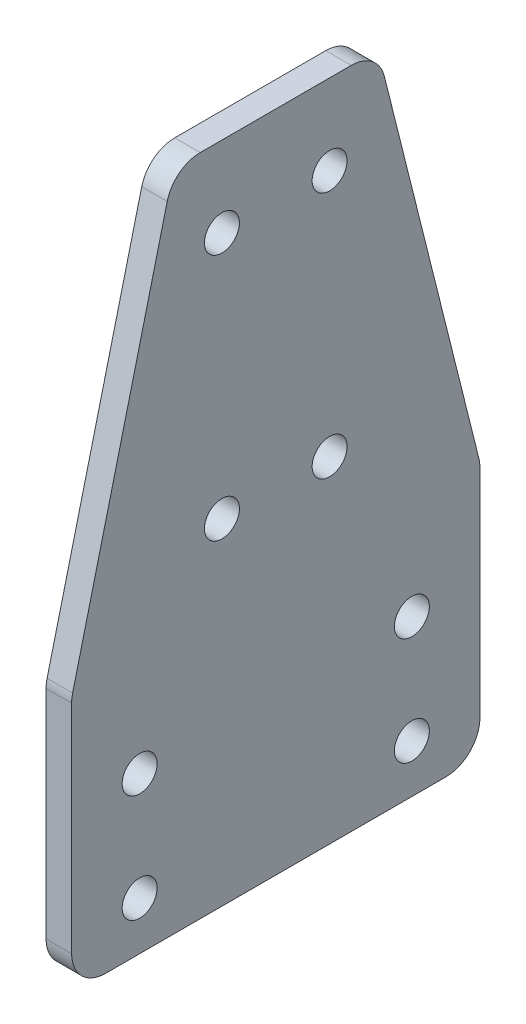
ISO-10303-21;
HEADER;
FILE_DESCRIPTION(('STEP AP214'),'2;1');
FILE_NAME('part.step','',(''),(''),'','','');
FILE_SCHEMA(('AUTOMOTIVE_DESIGN { 1 0 10303 214 1 1 1 1 }'));
ENDSEC;
DATA;
#1=APPLICATION_CONTEXT('core data for automotive mechanical design processes');
#2=APPLICATION_PROTOCOL_DEFINITION('international standard','automotive_design',2000,#1);
#3=PRODUCT_CONTEXT('',#1,'mechanical');
#4=PRODUCT('Part','Part','',(#3));
#5=PRODUCT_RELATED_PRODUCT_CATEGORY('part','',(#4));
#6=PRODUCT_DEFINITION_FORMATION('','',#4);
#7=PRODUCT_DEFINITION_CONTEXT('part definition',#1,'design');
#8=PRODUCT_DEFINITION('design','',#6,#7);
#9=PRODUCT_DEFINITION_SHAPE('','',#8);
#10=(LENGTH_UNIT() NAMED_UNIT(*) SI_UNIT(.MILLI.,.METRE.));
#11=(NAMED_UNIT(*) PLANE_ANGLE_UNIT() SI_UNIT($,.RADIAN.));
#12=(NAMED_UNIT(*) SI_UNIT($,.STERADIAN.) SOLID_ANGLE_UNIT());
#13=UNCERTAINTY_MEASURE_WITH_UNIT(LENGTH_MEASURE(1.E-05),#10,'distance_accuracy_value','');
#14=(GEOMETRIC_REPRESENTATION_CONTEXT(3) GLOBAL_UNCERTAINTY_ASSIGNED_CONTEXT((#13)) GLOBAL_UNIT_ASSIGNED_CONTEXT((#10,
#11,#12)) REPRESENTATION_CONTEXT('',''));
#15=CARTESIAN_POINT('',(0.,0.,0.));
#16=DIRECTION('',(0.,0.,1.));
#17=DIRECTION('',(1.,0.,0.));
#18=AXIS2_PLACEMENT_3D('',#15,#16,#17);
#19=CARTESIAN_POINT('',(-234.95,47.625,-130.7));
#20=DIRECTION('',(0.,0.,1.));
#21=DIRECTION('',(0.,-1.,0.));
#22=AXIS2_PLACEMENT_3D('',#19,#20,#21);
#23=PLANE('',#22);
#24=DIRECTION('',(0.,-1.,0.));
#25=VECTOR('',#24,1.);
#26=CARTESIAN_POINT('',(-234.95,47.625,-130.7));
#27=LINE('',#26,#25);
#28=CARTESIAN_POINT('',(-234.95,46.8432792773278,-130.7));
#29=VERTEX_POINT('',#28);
#30=CARTESIAN_POINT('',(-234.95,6.34999999999999,-130.7));
#31=VERTEX_POINT('',#30);
#32=EDGE_CURVE('E248',#29,#31,#27,.T.);
#33=ORIENTED_EDGE('',*,*,#32,.T.);
#34=DIRECTION('',(1.,0.,0.));
#35=VECTOR('',#34,1.);
#36=CARTESIAN_POINT('',(-234.95,6.34999999999999,-130.7));
#37=LINE('',#36,#35);
#38=CARTESIAN_POINT('',(-230.1875,6.34999999999999,-130.7));
#39=VERTEX_POINT('',#38);
#40=EDGE_CURVE('E156',#31,#39,#37,.T.);
#41=ORIENTED_EDGE('',*,*,#40,.T.);
#42=DIRECTION('',(0.,-1.,0.));
#43=VECTOR('',#42,1.);
#44=CARTESIAN_POINT('',(-230.1875,47.625,-130.7));
#45=LINE('',#44,#43);
#46=CARTESIAN_POINT('',(-230.1875,46.8432792773278,-130.7));
#47=VERTEX_POINT('',#46);
#48=EDGE_CURVE('E139',#47,#39,#45,.T.);
#49=ORIENTED_EDGE('',*,*,#48,.F.);
#50=DIRECTION('',(1.,0.,0.));
#51=VECTOR('',#50,1.);
#52=CARTESIAN_POINT('',(-234.95,46.8432792773278,-130.7));
#53=LINE('',#52,#51);
#54=EDGE_CURVE('E153',#47,#29,#53,.F.);
#55=ORIENTED_EDGE('',*,*,#54,.T.);
#56=EDGE_LOOP('',(#33,#41,#49,#55));
#57=FACE_BOUND('',#56,.T.);
#58=ADVANCED_FACE('F45',(#57),#23,.T.);
#59=CARTESIAN_POINT('',(-234.95,123.825,-149.75));
#60=DIRECTION('',(0.,0.242535625036333,0.970142500145332));
#61=DIRECTION('',(0.,-0.970142500145332,0.242535625036333));
#62=AXIS2_PLACEMENT_3D('',#59,#60,#61);
#63=PLANE('',#62);
#64=DIRECTION('',(0.,-0.970142500145332,0.242535625036333));
#65=VECTOR('',#64,1.);
#66=CARTESIAN_POINT('',(-234.95,123.825,-149.75));
#67=LINE('',#66,#65);
#68=CARTESIAN_POINT('',(-234.95,119.015101218981,-148.547525304745));
#69=VERTEX_POINT('',#68);
#70=CARTESIAN_POINT('',(-234.95,48.3833804963085,-130.889595124077));
#71=VERTEX_POINT('',#70);
#72=EDGE_CURVE('E165',#69,#71,#67,.T.);
#73=ORIENTED_EDGE('',*,*,#72,.T.);
#74=DIRECTION('',(1.,0.,0.));
#75=VECTOR('',#74,1.);
#76=CARTESIAN_POINT('',(-234.95,48.3833804963085,-130.889595124077));
#77=LINE('',#76,#75);
#78=CARTESIAN_POINT('',(-230.1875,48.3833804963085,-130.889595124077));
#79=VERTEX_POINT('',#78);
#80=EDGE_CURVE('E228',#71,#79,#77,.T.);
#81=ORIENTED_EDGE('',*,*,#80,.T.);
#82=DIRECTION('',(0.,-0.970142500145332,0.242535625036333));
#83=VECTOR('',#82,1.);
#84=CARTESIAN_POINT('',(-230.1875,123.825,-149.75));
#85=LINE('',#84,#83);
#86=CARTESIAN_POINT('',(-230.1875,119.015101218981,-148.547525304745));
#87=VERTEX_POINT('',#86);
#88=EDGE_CURVE('E141',#87,#79,#85,.T.);
#89=ORIENTED_EDGE('',*,*,#88,.F.);
#90=DIRECTION('',(1.,0.,0.));
#91=VECTOR('',#90,1.);
#92=CARTESIAN_POINT('',(-234.95,119.015101218981,-148.547525304745));
#93=LINE('',#92,#91);
#94=EDGE_CURVE('E225',#87,#69,#93,.F.);
#95=ORIENTED_EDGE('',*,*,#94,.T.);
#96=EDGE_LOOP('',(#73,#81,#89,#95));
#97=FACE_BOUND('',#96,.T.);
#98=ADVANCED_FACE('F379',(#97),#63,.T.);
#99=CARTESIAN_POINT('',(-234.95,123.825,-187.85));
#100=DIRECTION('',(0.,1.,0.));
#101=DIRECTION('',(0.,0.,1.));
#102=AXIS2_PLACEMENT_3D('',#99,#100,#101);
#103=PLANE('',#102);
#104=DIRECTION('',(0.,0.,1.));
#105=VECTOR('',#104,1.);
#106=CARTESIAN_POINT('',(-230.1875,123.825,-187.85));
#107=LINE('',#106,#105);
#108=CARTESIAN_POINT('',(-230.1875,123.825,-182.892069819332));
#109=VERTEX_POINT('',#108);
#110=CARTESIAN_POINT('',(-230.1875,123.825,-154.707930180668));
#111=VERTEX_POINT('',#110);
#112=EDGE_CURVE('E238',#109,#111,#107,.T.);
#113=ORIENTED_EDGE('',*,*,#112,.F.);
#114=DIRECTION('',(1.,0.,0.));
#115=VECTOR('',#114,1.);
#116=CARTESIAN_POINT('',(-234.95,123.825,-182.892069819332));
#117=LINE('',#116,#115);
#118=CARTESIAN_POINT('',(-234.95,123.825,-182.892069819332));
#119=VERTEX_POINT('',#118);
#120=EDGE_CURVE('E11',#109,#119,#117,.F.);
#121=ORIENTED_EDGE('',*,*,#120,.T.);
#122=DIRECTION('',(0.,0.,1.));
#123=VECTOR('',#122,1.);
#124=CARTESIAN_POINT('',(-234.95,123.825,-187.85));
#125=LINE('',#124,#123);
#126=CARTESIAN_POINT('',(-234.95,123.825,-154.707930180668));
#127=VERTEX_POINT('',#126);
#128=EDGE_CURVE('E172',#119,#127,#125,.T.);
#129=ORIENTED_EDGE('',*,*,#128,.T.);
#130=DIRECTION('',(1.,0.,0.));
#131=VECTOR('',#130,1.);
#132=CARTESIAN_POINT('',(-234.95,123.825,-154.707930180668));
#133=LINE('',#132,#131);
#134=EDGE_CURVE('E54',#127,#111,#133,.T.);
#135=ORIENTED_EDGE('',*,*,#134,.T.);
#136=EDGE_LOOP('',(#113,#121,#129,#135));
#137=FACE_BOUND('',#136,.T.);
#138=ADVANCED_FACE('F237',(#137),#103,.T.);
#139=CARTESIAN_POINT('',(-234.95,47.625,-206.9));
#140=DIRECTION('',(0.,0.242535625036333,-0.970142500145332));
#141=DIRECTION('',(0.,0.970142500145332,0.242535625036333));
#142=AXIS2_PLACEMENT_3D('',#139,#140,#141);
#143=PLANE('',#142);
#144=DIRECTION('',(0.,0.970142500145332,0.242535625036333));
#145=VECTOR('',#144,1.);
#146=CARTESIAN_POINT('',(-230.1875,47.625,-206.9));
#147=LINE('',#146,#145);
#148=CARTESIAN_POINT('',(-230.1875,48.3833804963085,-206.710404875923));
#149=VERTEX_POINT('',#148);
#150=CARTESIAN_POINT('',(-230.1875,119.015101218981,-189.052474695255));
#151=VERTEX_POINT('',#150);
#152=EDGE_CURVE('E245',#149,#151,#147,.T.);
#153=ORIENTED_EDGE('',*,*,#152,.F.);
#154=DIRECTION('',(1.,0.,0.));
#155=VECTOR('',#154,1.);
#156=CARTESIAN_POINT('',(-234.95,48.3833804963085,-206.710404875923));
#157=LINE('',#156,#155);
#158=CARTESIAN_POINT('',(-234.95,48.3833804963085,-206.710404875923));
#159=VERTEX_POINT('',#158);
#160=EDGE_CURVE('E222',#149,#159,#157,.F.);
#161=ORIENTED_EDGE('',*,*,#160,.T.);
#162=DIRECTION('',(0.,0.970142500145332,0.242535625036333));
#163=VECTOR('',#162,1.);
#164=CARTESIAN_POINT('',(-234.95,47.625,-206.9));
#165=LINE('',#164,#163);
#166=CARTESIAN_POINT('',(-234.95,119.015101218981,-189.052474695255));
#167=VERTEX_POINT('',#166);
#168=EDGE_CURVE('E260',#159,#167,#165,.T.);
#169=ORIENTED_EDGE('',*,*,#168,.T.);
#170=DIRECTION('',(1.,0.,0.));
#171=VECTOR('',#170,1.);
#172=CARTESIAN_POINT('',(-234.95,119.015101218981,-189.052474695255));
#173=LINE('',#172,#171);
#174=EDGE_CURVE('E218',#167,#151,#173,.T.);
#175=ORIENTED_EDGE('',*,*,#174,.T.);
#176=EDGE_LOOP('',(#153,#161,#169,#175));
#177=FACE_BOUND('',#176,.T.);
#178=ADVANCED_FACE('F413',(#177),#143,.T.);
#179=CARTESIAN_POINT('',(-234.95,0.,-206.9));
#180=DIRECTION('',(0.,0.,-1.));
#181=DIRECTION('',(-1.,0.,0.));
#182=AXIS2_PLACEMENT_3D('',#179,#180,#181);
#183=PLANE('',#182);
#184=DIRECTION('',(0.,1.,0.));
#185=VECTOR('',#184,1.);
#186=CARTESIAN_POINT('',(-230.1875,0.,-206.9));
#187=LINE('',#186,#185);
#188=CARTESIAN_POINT('',(-230.1875,6.35,-206.9));
#189=VERTEX_POINT('',#188);
#190=CARTESIAN_POINT('',(-230.1875,46.8432792773278,-206.9));
#191=VERTEX_POINT('',#190);
#192=EDGE_CURVE('E249',#189,#191,#187,.T.);
#193=ORIENTED_EDGE('',*,*,#192,.F.);
#194=DIRECTION('',(1.,0.,0.));
#195=VECTOR('',#194,1.);
#196=CARTESIAN_POINT('',(-234.95,6.35,-206.9));
#197=LINE('',#196,#195);
#198=CARTESIAN_POINT('',(-234.95,6.35,-206.9));
#199=VERTEX_POINT('',#198);
#200=EDGE_CURVE('E68',#189,#199,#197,.F.);
#201=ORIENTED_EDGE('',*,*,#200,.T.);
#202=DIRECTION('',(0.,1.,0.));
#203=VECTOR('',#202,1.);
#204=CARTESIAN_POINT('',(-234.95,0.,-206.9));
#205=LINE('',#204,#203);
#206=CARTESIAN_POINT('',(-234.95,46.8432792773278,-206.9));
#207=VERTEX_POINT('',#206);
#208=EDGE_CURVE('E264',#199,#207,#205,.T.);
#209=ORIENTED_EDGE('',*,*,#208,.T.);
#210=DIRECTION('',(1.,0.,0.));
#211=VECTOR('',#210,1.);
#212=CARTESIAN_POINT('',(-234.95,46.8432792773278,-206.9));
#213=LINE('',#212,#211);
#214=EDGE_CURVE('E212',#207,#191,#213,.T.);
#215=ORIENTED_EDGE('',*,*,#214,.T.);
#216=EDGE_LOOP('',(#193,#201,#209,#215));
#217=FACE_BOUND('',#216,.T.);
#218=ADVANCED_FACE('F416',(#217),#183,.T.);
#219=CARTESIAN_POINT('',(-234.95,0.,-130.7));
#220=DIRECTION('',(0.,-1.,0.));
#221=DIRECTION('',(0.,0.,-1.));
#222=AXIS2_PLACEMENT_3D('',#219,#220,#221);
#223=PLANE('',#222);
#224=DIRECTION('',(0.,0.,-1.));
#225=VECTOR('',#224,1.);
#226=CARTESIAN_POINT('',(-230.1875,0.,-130.7));
#227=LINE('',#226,#225);
#228=CARTESIAN_POINT('',(-230.1875,0.,-137.05));
#229=VERTEX_POINT('',#228);
#230=CARTESIAN_POINT('',(-230.1875,0.,-200.55));
#231=VERTEX_POINT('',#230);
#232=EDGE_CURVE('E158',#229,#231,#227,.T.);
#233=ORIENTED_EDGE('',*,*,#232,.F.);
#234=DIRECTION('',(1.,0.,0.));
#235=VECTOR('',#234,1.);
#236=CARTESIAN_POINT('',(-234.95,0.,-137.05));
#237=LINE('',#236,#235);
#238=CARTESIAN_POINT('',(-234.95,0.,-137.05));
#239=VERTEX_POINT('',#238);
#240=EDGE_CURVE('E193',#229,#239,#237,.F.);
#241=ORIENTED_EDGE('',*,*,#240,.T.);
#242=DIRECTION('',(0.,0.,-1.));
#243=VECTOR('',#242,1.);
#244=CARTESIAN_POINT('',(-234.95,0.,-130.7));
#245=LINE('',#244,#243);
#246=CARTESIAN_POINT('',(-234.95,0.,-200.55));
#247=VERTEX_POINT('',#246);
#248=EDGE_CURVE('E267',#239,#247,#245,.T.);
#249=ORIENTED_EDGE('',*,*,#248,.T.);
#250=DIRECTION('',(1.,0.,0.));
#251=VECTOR('',#250,1.);
#252=CARTESIAN_POINT('',(-234.95,0.,-200.55));
#253=LINE('',#252,#251);
#254=EDGE_CURVE('E189',#247,#231,#253,.T.);
#255=ORIENTED_EDGE('',*,*,#254,.T.);
#256=EDGE_LOOP('',(#233,#241,#249,#255));
#257=FACE_BOUND('',#256,.T.);
#258=ADVANCED_FACE('F388',(#257),#223,.T.);
#259=CARTESIAN_POINT('',(-234.95,0.,0.));
#260=DIRECTION('',(1.,0.,0.));
#261=DIRECTION('',(0.,0.,-1.));
#262=AXIS2_PLACEMENT_3D('',#259,#260,#261);
#263=PLANE('',#262);
#264=CARTESIAN_POINT('',(-234.95,9.,-194.2));
#265=DIRECTION('',(1.,0.,0.));
#266=DIRECTION('',(0.,0.,-1.));
#267=AXIS2_PLACEMENT_3D('',#264,#265,#266);
#268=CIRCLE('',#267,3.26390000000001);
#269=CARTESIAN_POINT('',(-234.95,9.,-197.4639));
#270=VERTEX_POINT('',#269);
#271=EDGE_CURVE('E325',#270,#270,#268,.T.);
#272=ORIENTED_EDGE('',*,*,#271,.T.);
#273=EDGE_LOOP('',(#272));
#274=FACE_BOUND('',#273,.T.);
#275=CARTESIAN_POINT('',(-234.95,9.,-143.4));
#276=DIRECTION('',(1.,0.,0.));
#277=DIRECTION('',(0.,0.,-1.));
#278=AXIS2_PLACEMENT_3D('',#275,#276,#277);
#279=CIRCLE('',#278,3.26390000000001);
#280=CARTESIAN_POINT('',(-234.95,9.,-146.6639));
#281=VERTEX_POINT('',#280);
#282=EDGE_CURVE('E317',#281,#281,#279,.T.);
#283=ORIENTED_EDGE('',*,*,#282,.T.);
#284=EDGE_LOOP('',(#283));
#285=FACE_BOUND('',#284,.T.);
#286=CARTESIAN_POINT('',(-234.95,29.1,-143.4));
#287=DIRECTION('',(1.,0.,0.));
#288=DIRECTION('',(0.,0.,-1.));
#289=AXIS2_PLACEMENT_3D('',#286,#287,#288);
#290=CIRCLE('',#289,3.26390000000001);
#291=CARTESIAN_POINT('',(-234.95,29.1,-146.6639));
#292=VERTEX_POINT('',#291);
#293=EDGE_CURVE('E309',#292,#292,#290,.T.);
#294=ORIENTED_EDGE('',*,*,#293,.T.);
#295=EDGE_LOOP('',(#294));
#296=FACE_BOUND('',#295,.T.);
#297=CARTESIAN_POINT('',(-234.95,62.625,-158.75));
#298=DIRECTION('',(1.,0.,0.));
#299=DIRECTION('',(0.,0.,-1.));
#300=AXIS2_PLACEMENT_3D('',#297,#298,#299);
#301=CIRCLE('',#300,3.26389999999998);
#302=CARTESIAN_POINT('',(-234.95,62.625,-162.0139));
#303=VERTEX_POINT('',#302);
#304=EDGE_CURVE('E301',#303,#303,#301,.T.);
#305=ORIENTED_EDGE('',*,*,#304,.T.);
#306=EDGE_LOOP('',(#305));
#307=FACE_BOUND('',#306,.T.);
#308=CARTESIAN_POINT('',(-234.95,62.625,-178.85));
#309=DIRECTION('',(1.,0.,0.));
#310=DIRECTION('',(0.,0.,-1.));
#311=AXIS2_PLACEMENT_3D('',#308,#309,#310);
#312=CIRCLE('',#311,3.26390000000001);
#313=CARTESIAN_POINT('',(-234.95,62.625,-182.1139));
#314=VERTEX_POINT('',#313);
#315=EDGE_CURVE('E293',#314,#314,#312,.T.);
#316=ORIENTED_EDGE('',*,*,#315,.T.);
#317=EDGE_LOOP('',(#316));
#318=FACE_BOUND('',#317,.T.);
#319=CARTESIAN_POINT('',(-234.95,108.825000028,-178.85));
#320=DIRECTION('',(1.,0.,0.));
#321=DIRECTION('',(0.,0.,-1.));
#322=AXIS2_PLACEMENT_3D('',#319,#320,#321);
#323=CIRCLE('',#322,3.26390000000001);
#324=CARTESIAN_POINT('',(-234.95,108.825000028,-182.1139));
#325=VERTEX_POINT('',#324);
#326=EDGE_CURVE('E285',#325,#325,#323,.T.);
#327=ORIENTED_EDGE('',*,*,#326,.T.);
#328=EDGE_LOOP('',(#327));
#329=FACE_BOUND('',#328,.T.);
#330=CARTESIAN_POINT('',(-234.95,108.825000028,-158.75));
#331=DIRECTION('',(1.,0.,0.));
#332=DIRECTION('',(0.,0.,-1.));
#333=AXIS2_PLACEMENT_3D('',#330,#331,#332);
#334=CIRCLE('',#333,3.26389999999998);
#335=CARTESIAN_POINT('',(-234.95,108.825000028,-162.0139));
#336=VERTEX_POINT('',#335);
#337=EDGE_CURVE('E277',#336,#336,#334,.T.);
#338=ORIENTED_EDGE('',*,*,#337,.T.);
#339=EDGE_LOOP('',(#338));
#340=FACE_BOUND('',#339,.T.);
#341=CARTESIAN_POINT('',(-234.95,29.1,-194.2));
#342=DIRECTION('',(1.,0.,0.));
#343=DIRECTION('',(0.,0.,-1.));
#344=AXIS2_PLACEMENT_3D('',#341,#342,#343);
#345=CIRCLE('',#344,3.26390000000001);
#346=CARTESIAN_POINT('',(-234.95,29.1,-197.4639));
#347=VERTEX_POINT('',#346);
#348=EDGE_CURVE('E159',#347,#347,#345,.T.);
#349=ORIENTED_EDGE('',*,*,#348,.T.);
#350=EDGE_LOOP('',(#349));
#351=FACE_BOUND('',#350,.T.);
#352=ORIENTED_EDGE('',*,*,#248,.F.);
#353=CARTESIAN_POINT('',(-234.95,6.35,-137.05));
#354=DIRECTION('',(1.,0.,0.));
#355=DIRECTION('',(0.,0.,-1.));
#356=AXIS2_PLACEMENT_3D('',#353,#354,#355);
#357=CIRCLE('',#356,6.35);
#358=EDGE_CURVE('E209',#239,#31,#357,.F.);
#359=ORIENTED_EDGE('',*,*,#358,.T.);
#360=ORIENTED_EDGE('',*,*,#32,.F.);
#361=CARTESIAN_POINT('',(-234.95,46.8432792773278,-137.05));
#362=DIRECTION('',(1.,0.,0.));
#363=DIRECTION('',(0.,0.,-1.));
#364=AXIS2_PLACEMENT_3D('',#361,#362,#363);
#365=CIRCLE('',#364,6.35);
#366=EDGE_CURVE('E163',#29,#71,#365,.F.);
#367=ORIENTED_EDGE('',*,*,#366,.T.);
#368=ORIENTED_EDGE('',*,*,#72,.F.);
#369=CARTESIAN_POINT('',(-234.95,117.475,-154.707930180668));
#370=DIRECTION('',(1.,0.,0.));
#371=DIRECTION('',(0.,0.,-1.));
#372=AXIS2_PLACEMENT_3D('',#369,#370,#371);
#373=CIRCLE('',#372,6.35);
#374=EDGE_CURVE('E196',#69,#127,#373,.F.);
#375=ORIENTED_EDGE('',*,*,#374,.T.);
#376=ORIENTED_EDGE('',*,*,#128,.F.);
#377=CARTESIAN_POINT('',(-234.95,117.475,-182.892069819332));
#378=DIRECTION('',(1.,0.,0.));
#379=DIRECTION('',(0.,0.,-1.));
#380=AXIS2_PLACEMENT_3D('',#377,#378,#379);
#381=CIRCLE('',#380,6.35);
#382=EDGE_CURVE('E199',#119,#167,#381,.F.);
#383=ORIENTED_EDGE('',*,*,#382,.T.);
#384=ORIENTED_EDGE('',*,*,#168,.F.);
#385=CARTESIAN_POINT('',(-234.95,46.8432792773278,-200.55));
#386=DIRECTION('',(1.,0.,0.));
#387=DIRECTION('',(0.,0.,-1.));
#388=AXIS2_PLACEMENT_3D('',#385,#386,#387);
#389=CIRCLE('',#388,6.35);
#390=EDGE_CURVE('E61',#159,#207,#389,.F.);
#391=ORIENTED_EDGE('',*,*,#390,.T.);
#392=ORIENTED_EDGE('',*,*,#208,.F.);
#393=CARTESIAN_POINT('',(-234.95,6.35,-200.55));
#394=DIRECTION('',(1.,0.,0.));
#395=DIRECTION('',(0.,0.,-1.));
#396=AXIS2_PLACEMENT_3D('',#393,#394,#395);
#397=CIRCLE('',#396,6.35);
#398=EDGE_CURVE('E206',#199,#247,#397,.F.);
#399=ORIENTED_EDGE('',*,*,#398,.T.);
#400=EDGE_LOOP('',(#352,#359,#360,#367,#368,#375,#376,#383,#384,#391,#392,#399));
#401=FACE_BOUND('',#400,.T.);
#402=ADVANCED_FACE('F337',(#274,#285,#296,#307,#318,#329,#340,#351,#401),#263,.F.);
#403=CARTESIAN_POINT('',(-230.1875,0.,0.));
#404=DIRECTION('',(1.,0.,0.));
#405=DIRECTION('',(0.,0.,-1.));
#406=AXIS2_PLACEMENT_3D('',#403,#404,#405);
#407=PLANE('',#406);
#408=CARTESIAN_POINT('',(-230.1875,9.,-194.2));
#409=DIRECTION('',(1.,0.,0.));
#410=DIRECTION('',(0.,0.,-1.));
#411=AXIS2_PLACEMENT_3D('',#408,#409,#410);
#412=CIRCLE('',#411,3.26390000000001);
#413=CARTESIAN_POINT('',(-230.1875,9.,-197.4639));
#414=VERTEX_POINT('',#413);
#415=EDGE_CURVE('E329',#414,#414,#412,.T.);
#416=ORIENTED_EDGE('',*,*,#415,.F.);
#417=EDGE_LOOP('',(#416));
#418=FACE_BOUND('',#417,.T.);
#419=CARTESIAN_POINT('',(-230.1875,9.,-143.4));
#420=DIRECTION('',(1.,0.,0.));
#421=DIRECTION('',(0.,0.,-1.));
#422=AXIS2_PLACEMENT_3D('',#419,#420,#421);
#423=CIRCLE('',#422,3.26390000000001);
#424=CARTESIAN_POINT('',(-230.1875,9.,-146.6639));
#425=VERTEX_POINT('',#424);
#426=EDGE_CURVE('E321',#425,#425,#423,.T.);
#427=ORIENTED_EDGE('',*,*,#426,.F.);
#428=EDGE_LOOP('',(#427));
#429=FACE_BOUND('',#428,.T.);
#430=CARTESIAN_POINT('',(-230.1875,29.1,-143.4));
#431=DIRECTION('',(1.,0.,0.));
#432=DIRECTION('',(0.,0.,-1.));
#433=AXIS2_PLACEMENT_3D('',#430,#431,#432);
#434=CIRCLE('',#433,3.26390000000001);
#435=CARTESIAN_POINT('',(-230.1875,29.1,-146.6639));
#436=VERTEX_POINT('',#435);
#437=EDGE_CURVE('E313',#436,#436,#434,.T.);
#438=ORIENTED_EDGE('',*,*,#437,.F.);
#439=EDGE_LOOP('',(#438));
#440=FACE_BOUND('',#439,.T.);
#441=CARTESIAN_POINT('',(-230.1875,62.625,-158.75));
#442=DIRECTION('',(1.,0.,0.));
#443=DIRECTION('',(0.,0.,-1.));
#444=AXIS2_PLACEMENT_3D('',#441,#442,#443);
#445=CIRCLE('',#444,3.26389999999998);
#446=CARTESIAN_POINT('',(-230.1875,62.625,-162.0139));
#447=VERTEX_POINT('',#446);
#448=EDGE_CURVE('E305',#447,#447,#445,.T.);
#449=ORIENTED_EDGE('',*,*,#448,.F.);
#450=EDGE_LOOP('',(#449));
#451=FACE_BOUND('',#450,.T.);
#452=CARTESIAN_POINT('',(-230.1875,62.625,-178.85));
#453=DIRECTION('',(1.,0.,0.));
#454=DIRECTION('',(0.,0.,-1.));
#455=AXIS2_PLACEMENT_3D('',#452,#453,#454);
#456=CIRCLE('',#455,3.26390000000001);
#457=CARTESIAN_POINT('',(-230.1875,62.625,-182.1139));
#458=VERTEX_POINT('',#457);
#459=EDGE_CURVE('E297',#458,#458,#456,.T.);
#460=ORIENTED_EDGE('',*,*,#459,.F.);
#461=EDGE_LOOP('',(#460));
#462=FACE_BOUND('',#461,.T.);
#463=CARTESIAN_POINT('',(-230.1875,108.825000028,-178.85));
#464=DIRECTION('',(1.,0.,0.));
#465=DIRECTION('',(0.,0.,-1.));
#466=AXIS2_PLACEMENT_3D('',#463,#464,#465);
#467=CIRCLE('',#466,3.26390000000001);
#468=CARTESIAN_POINT('',(-230.1875,108.825000028,-182.1139));
#469=VERTEX_POINT('',#468);
#470=EDGE_CURVE('E289',#469,#469,#467,.T.);
#471=ORIENTED_EDGE('',*,*,#470,.F.);
#472=EDGE_LOOP('',(#471));
#473=FACE_BOUND('',#472,.T.);
#474=CARTESIAN_POINT('',(-230.1875,108.825000028,-158.75));
#475=DIRECTION('',(1.,0.,0.));
#476=DIRECTION('',(0.,0.,-1.));
#477=AXIS2_PLACEMENT_3D('',#474,#475,#476);
#478=CIRCLE('',#477,3.26389999999998);
#479=CARTESIAN_POINT('',(-230.1875,108.825000028,-162.0139));
#480=VERTEX_POINT('',#479);
#481=EDGE_CURVE('E281',#480,#480,#478,.T.);
#482=ORIENTED_EDGE('',*,*,#481,.F.);
#483=EDGE_LOOP('',(#482));
#484=FACE_BOUND('',#483,.T.);
#485=CARTESIAN_POINT('',(-230.1875,29.1,-194.2));
#486=DIRECTION('',(1.,0.,0.));
#487=DIRECTION('',(0.,0.,-1.));
#488=AXIS2_PLACEMENT_3D('',#485,#486,#487);
#489=CIRCLE('',#488,3.26390000000001);
#490=CARTESIAN_POINT('',(-230.1875,29.1,-197.4639));
#491=VERTEX_POINT('',#490);
#492=EDGE_CURVE('E273',#491,#491,#489,.T.);
#493=ORIENTED_EDGE('',*,*,#492,.F.);
#494=EDGE_LOOP('',(#493));
#495=FACE_BOUND('',#494,.T.);
#496=ORIENTED_EDGE('',*,*,#48,.T.);
#497=CARTESIAN_POINT('',(-230.1875,6.35,-137.05));
#498=DIRECTION('',(1.,0.,0.));
#499=DIRECTION('',(0.,0.,-1.));
#500=AXIS2_PLACEMENT_3D('',#497,#498,#499);
#501=CIRCLE('',#500,6.35);
#502=EDGE_CURVE('E186',#39,#229,#501,.T.);
#503=ORIENTED_EDGE('',*,*,#502,.T.);
#504=ORIENTED_EDGE('',*,*,#232,.T.);
#505=CARTESIAN_POINT('',(-230.1875,6.35,-200.55));
#506=DIRECTION('',(1.,0.,0.));
#507=DIRECTION('',(0.,0.,-1.));
#508=AXIS2_PLACEMENT_3D('',#505,#506,#507);
#509=CIRCLE('',#508,6.35);
#510=EDGE_CURVE('E183',#231,#189,#509,.T.);
#511=ORIENTED_EDGE('',*,*,#510,.T.);
#512=ORIENTED_EDGE('',*,*,#192,.T.);
#513=CARTESIAN_POINT('',(-230.1875,46.8432792773278,-200.55));
#514=DIRECTION('',(1.,0.,0.));
#515=DIRECTION('',(0.,0.,-1.));
#516=AXIS2_PLACEMENT_3D('',#513,#514,#515);
#517=CIRCLE('',#516,6.35);
#518=EDGE_CURVE('E147',#191,#149,#517,.T.);
#519=ORIENTED_EDGE('',*,*,#518,.T.);
#520=ORIENTED_EDGE('',*,*,#152,.T.);
#521=CARTESIAN_POINT('',(-230.1875,117.475,-182.892069819332));
#522=DIRECTION('',(1.,0.,0.));
#523=DIRECTION('',(0.,0.,-1.));
#524=AXIS2_PLACEMENT_3D('',#521,#522,#523);
#525=CIRCLE('',#524,6.35);
#526=EDGE_CURVE('E148',#151,#109,#525,.T.);
#527=ORIENTED_EDGE('',*,*,#526,.T.);
#528=ORIENTED_EDGE('',*,*,#112,.T.);
#529=CARTESIAN_POINT('',(-230.1875,117.475,-154.707930180668));
#530=DIRECTION('',(1.,0.,0.));
#531=DIRECTION('',(0.,0.,-1.));
#532=AXIS2_PLACEMENT_3D('',#529,#530,#531);
#533=CIRCLE('',#532,6.35);
#534=EDGE_CURVE('E169',#111,#87,#533,.T.);
#535=ORIENTED_EDGE('',*,*,#534,.T.);
#536=ORIENTED_EDGE('',*,*,#88,.T.);
#537=CARTESIAN_POINT('',(-230.1875,46.8432792773278,-137.05));
#538=DIRECTION('',(1.,0.,0.));
#539=DIRECTION('',(0.,0.,-1.));
#540=AXIS2_PLACEMENT_3D('',#537,#538,#539);
#541=CIRCLE('',#540,6.35);
#542=EDGE_CURVE('E136',#79,#47,#541,.T.);
#543=ORIENTED_EDGE('',*,*,#542,.T.);
#544=EDGE_LOOP('',(#496,#503,#504,#511,#512,#519,#520,#527,#528,#535,#536,#543));
#545=FACE_BOUND('',#544,.T.);
#546=ADVANCED_FACE('F138',(#418,#429,#440,#451,#462,#473,#484,#495,#545),#407,.T.);
#547=CARTESIAN_POINT('',(-234.95,29.1,-194.2));
#548=DIRECTION('',(1.,0.,0.));
#549=DIRECTION('',(0.,0.,-1.));
#550=AXIS2_PLACEMENT_3D('',#547,#548,#549);
#551=CYLINDRICAL_SURFACE('',#550,3.26390000000001);
#552=ORIENTED_EDGE('',*,*,#348,.F.);
#553=EDGE_LOOP('',(#552));
#554=FACE_BOUND('',#553,.T.);
#555=ORIENTED_EDGE('',*,*,#492,.T.);
#556=EDGE_LOOP('',(#555));
#557=FACE_BOUND('',#556,.T.);
#558=ADVANCED_FACE('F350',(#554,#557),#551,.F.);
#559=CARTESIAN_POINT('',(-234.95,108.825000028,-158.75));
#560=DIRECTION('',(1.,0.,0.));
#561=DIRECTION('',(0.,0.,-1.));
#562=AXIS2_PLACEMENT_3D('',#559,#560,#561);
#563=CYLINDRICAL_SURFACE('',#562,3.26389999999998);
#564=ORIENTED_EDGE('',*,*,#337,.F.);
#565=EDGE_LOOP('',(#564));
#566=FACE_BOUND('',#565,.T.);
#567=ORIENTED_EDGE('',*,*,#481,.T.);
#568=EDGE_LOOP('',(#567));
#569=FACE_BOUND('',#568,.T.);
#570=ADVANCED_FACE('F367',(#566,#569),#563,.F.);
#571=CARTESIAN_POINT('',(-234.95,108.825000028,-178.85));
#572=DIRECTION('',(1.,0.,0.));
#573=DIRECTION('',(0.,0.,-1.));
#574=AXIS2_PLACEMENT_3D('',#571,#572,#573);
#575=CYLINDRICAL_SURFACE('',#574,3.26390000000001);
#576=ORIENTED_EDGE('',*,*,#326,.F.);
#577=EDGE_LOOP('',(#576));
#578=FACE_BOUND('',#577,.T.);
#579=ORIENTED_EDGE('',*,*,#470,.T.);
#580=EDGE_LOOP('',(#579));
#581=FACE_BOUND('',#580,.T.);
#582=ADVANCED_FACE('F373',(#578,#581),#575,.F.);
#583=CARTESIAN_POINT('',(-234.95,62.625,-178.85));
#584=DIRECTION('',(1.,0.,0.));
#585=DIRECTION('',(0.,0.,-1.));
#586=AXIS2_PLACEMENT_3D('',#583,#584,#585);
#587=CYLINDRICAL_SURFACE('',#586,3.26390000000001);
#588=ORIENTED_EDGE('',*,*,#315,.F.);
#589=EDGE_LOOP('',(#588));
#590=FACE_BOUND('',#589,.T.);
#591=ORIENTED_EDGE('',*,*,#459,.T.);
#592=EDGE_LOOP('',(#591));
#593=FACE_BOUND('',#592,.T.);
#594=ADVANCED_FACE('F485',(#590,#593),#587,.F.);
#595=CARTESIAN_POINT('',(-234.95,62.625,-158.75));
#596=DIRECTION('',(1.,0.,0.));
#597=DIRECTION('',(0.,0.,-1.));
#598=AXIS2_PLACEMENT_3D('',#595,#596,#597);
#599=CYLINDRICAL_SURFACE('',#598,3.26389999999998);
#600=ORIENTED_EDGE('',*,*,#304,.F.);
#601=EDGE_LOOP('',(#600));
#602=FACE_BOUND('',#601,.T.);
#603=ORIENTED_EDGE('',*,*,#448,.T.);
#604=EDGE_LOOP('',(#603));
#605=FACE_BOUND('',#604,.T.);
#606=ADVANCED_FACE('F495',(#602,#605),#599,.F.);
#607=CARTESIAN_POINT('',(-234.95,29.1,-143.4));
#608=DIRECTION('',(1.,0.,0.));
#609=DIRECTION('',(0.,0.,-1.));
#610=AXIS2_PLACEMENT_3D('',#607,#608,#609);
#611=CYLINDRICAL_SURFACE('',#610,3.26390000000001);
#612=ORIENTED_EDGE('',*,*,#293,.F.);
#613=EDGE_LOOP('',(#612));
#614=FACE_BOUND('',#613,.T.);
#615=ORIENTED_EDGE('',*,*,#437,.T.);
#616=EDGE_LOOP('',(#615));
#617=FACE_BOUND('',#616,.T.);
#618=ADVANCED_FACE('F505',(#614,#617),#611,.F.);
#619=CARTESIAN_POINT('',(-234.95,9.,-143.4));
#620=DIRECTION('',(1.,0.,0.));
#621=DIRECTION('',(0.,0.,-1.));
#622=AXIS2_PLACEMENT_3D('',#619,#620,#621);
#623=CYLINDRICAL_SURFACE('',#622,3.26390000000001);
#624=ORIENTED_EDGE('',*,*,#282,.F.);
#625=EDGE_LOOP('',(#624));
#626=FACE_BOUND('',#625,.T.);
#627=ORIENTED_EDGE('',*,*,#426,.T.);
#628=EDGE_LOOP('',(#627));
#629=FACE_BOUND('',#628,.T.);
#630=ADVANCED_FACE('F344',(#626,#629),#623,.F.);
#631=CARTESIAN_POINT('',(-234.95,9.,-194.2));
#632=DIRECTION('',(1.,0.,0.));
#633=DIRECTION('',(0.,0.,-1.));
#634=AXIS2_PLACEMENT_3D('',#631,#632,#633);
#635=CYLINDRICAL_SURFACE('',#634,3.26390000000001);
#636=ORIENTED_EDGE('',*,*,#271,.F.);
#637=EDGE_LOOP('',(#636));
#638=FACE_BOUND('',#637,.T.);
#639=ORIENTED_EDGE('',*,*,#415,.T.);
#640=EDGE_LOOP('',(#639));
#641=FACE_BOUND('',#640,.T.);
#642=ADVANCED_FACE('F340',(#638,#641),#635,.F.);
#643=CARTESIAN_POINT('',(-234.95,6.35,-137.05));
#644=DIRECTION('',(1.,0.,0.));
#645=DIRECTION('',(0.,0.,-1.));
#646=AXIS2_PLACEMENT_3D('',#643,#644,#645);
#647=CYLINDRICAL_SURFACE('',#646,6.35);
#648=ORIENTED_EDGE('',*,*,#358,.F.);
#649=ORIENTED_EDGE('',*,*,#240,.F.);
#650=ORIENTED_EDGE('',*,*,#502,.F.);
#651=ORIENTED_EDGE('',*,*,#40,.F.);
#652=EDGE_LOOP('',(#648,#649,#650,#651));
#653=FACE_BOUND('',#652,.T.);
#654=ADVANCED_FACE('F343',(#653),#647,.T.);
#655=CARTESIAN_POINT('',(-234.95,6.35,-200.55));
#656=DIRECTION('',(1.,0.,0.));
#657=DIRECTION('',(0.,0.,-1.));
#658=AXIS2_PLACEMENT_3D('',#655,#656,#657);
#659=CYLINDRICAL_SURFACE('',#658,6.35);
#660=ORIENTED_EDGE('',*,*,#398,.F.);
#661=ORIENTED_EDGE('',*,*,#200,.F.);
#662=ORIENTED_EDGE('',*,*,#510,.F.);
#663=ORIENTED_EDGE('',*,*,#254,.F.);
#664=EDGE_LOOP('',(#660,#661,#662,#663));
#665=FACE_BOUND('',#664,.T.);
#666=ADVANCED_FACE('F392',(#665),#659,.T.);
#667=CARTESIAN_POINT('',(-234.95,46.8432792773278,-200.55));
#668=DIRECTION('',(1.,0.,0.));
#669=DIRECTION('',(0.,0.,-1.));
#670=AXIS2_PLACEMENT_3D('',#667,#668,#669);
#671=CYLINDRICAL_SURFACE('',#670,6.35);
#672=ORIENTED_EDGE('',*,*,#390,.F.);
#673=ORIENTED_EDGE('',*,*,#160,.F.);
#674=ORIENTED_EDGE('',*,*,#518,.F.);
#675=ORIENTED_EDGE('',*,*,#214,.F.);
#676=EDGE_LOOP('',(#672,#673,#674,#675));
#677=FACE_BOUND('',#676,.T.);
#678=ADVANCED_FACE('F396',(#677),#671,.T.);
#679=CARTESIAN_POINT('',(-234.95,46.8432792773278,-137.05));
#680=DIRECTION('',(1.,0.,0.));
#681=DIRECTION('',(0.,0.,-1.));
#682=AXIS2_PLACEMENT_3D('',#679,#680,#681);
#683=CYLINDRICAL_SURFACE('',#682,6.35);
#684=ORIENTED_EDGE('',*,*,#366,.F.);
#685=ORIENTED_EDGE('',*,*,#54,.F.);
#686=ORIENTED_EDGE('',*,*,#542,.F.);
#687=ORIENTED_EDGE('',*,*,#80,.F.);
#688=EDGE_LOOP('',(#684,#685,#686,#687));
#689=FACE_BOUND('',#688,.T.);
#690=ADVANCED_FACE('F162',(#689),#683,.T.);
#691=CARTESIAN_POINT('',(-234.95,117.475,-182.892069819332));
#692=DIRECTION('',(1.,0.,0.));
#693=DIRECTION('',(0.,0.,-1.));
#694=AXIS2_PLACEMENT_3D('',#691,#692,#693);
#695=CYLINDRICAL_SURFACE('',#694,6.35);
#696=ORIENTED_EDGE('',*,*,#382,.F.);
#697=ORIENTED_EDGE('',*,*,#120,.F.);
#698=ORIENTED_EDGE('',*,*,#526,.F.);
#699=ORIENTED_EDGE('',*,*,#174,.F.);
#700=EDGE_LOOP('',(#696,#697,#698,#699));
#701=FACE_BOUND('',#700,.T.);
#702=ADVANCED_FACE('F402',(#701),#695,.T.);
#703=CARTESIAN_POINT('',(-234.95,117.475,-154.707930180668));
#704=DIRECTION('',(1.,0.,0.));
#705=DIRECTION('',(0.,0.,-1.));
#706=AXIS2_PLACEMENT_3D('',#703,#704,#705);
#707=CYLINDRICAL_SURFACE('',#706,6.35);
#708=ORIENTED_EDGE('',*,*,#374,.F.);
#709=ORIENTED_EDGE('',*,*,#94,.F.);
#710=ORIENTED_EDGE('',*,*,#534,.F.);
#711=ORIENTED_EDGE('',*,*,#134,.F.);
#712=EDGE_LOOP('',(#708,#709,#710,#711));
#713=FACE_BOUND('',#712,.T.);
#714=ADVANCED_FACE('F47',(#713),#707,.T.);
#715=CLOSED_SHELL('',(#58,#98,#138,#178,#218,#258,#402,#546,#558,#570,#582,#594,#606,#618,#630,
#642,#654,#666,#678,#690,#702,#714));
#716=MANIFOLD_SOLID_BREP('B2',#715);
#717=ADVANCED_BREP_SHAPE_REPRESENTATION('',(#18,#716),#14);
#718=SHAPE_DEFINITION_REPRESENTATION(#9,#717);
ENDSEC;
END-ISO-10303-21;
